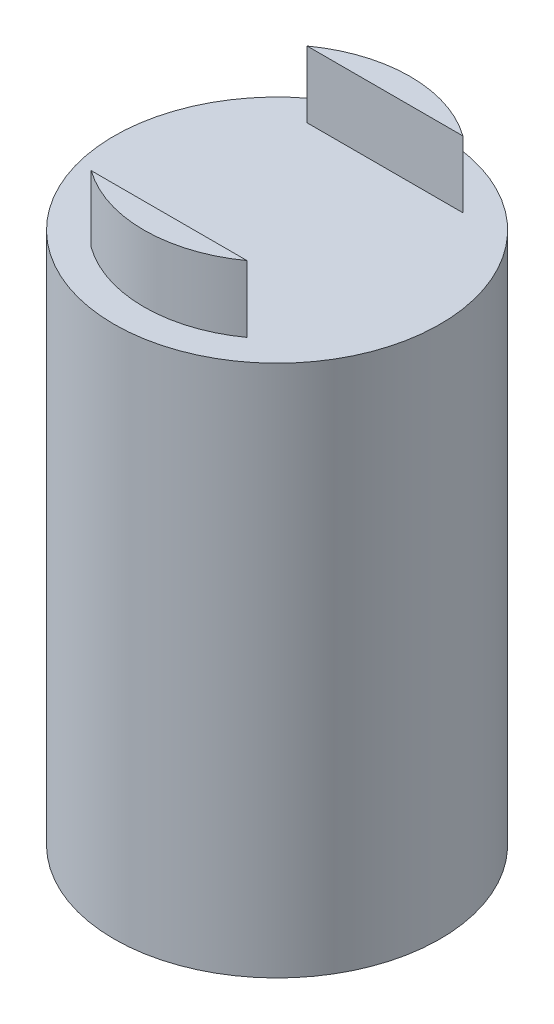
ISO-10303-21;
HEADER;
FILE_DESCRIPTION(('STEP AP214'),'2;1');
FILE_NAME('part.step','',(''),(''),'','','');
FILE_SCHEMA(('AUTOMOTIVE_DESIGN { 1 0 10303 214 1 1 1 1 }'));
ENDSEC;
DATA;
#1=APPLICATION_CONTEXT('core data for automotive mechanical design processes');
#2=APPLICATION_PROTOCOL_DEFINITION('international standard','automotive_design',2000,#1);
#3=PRODUCT_CONTEXT('',#1,'mechanical');
#4=PRODUCT('Part','Part','',(#3));
#5=PRODUCT_RELATED_PRODUCT_CATEGORY('part','',(#4));
#6=PRODUCT_DEFINITION_FORMATION('','',#4);
#7=PRODUCT_DEFINITION_CONTEXT('part definition',#1,'design');
#8=PRODUCT_DEFINITION('design','',#6,#7);
#9=PRODUCT_DEFINITION_SHAPE('','',#8);
#10=(LENGTH_UNIT() NAMED_UNIT(*) SI_UNIT(.MILLI.,.METRE.));
#11=(NAMED_UNIT(*) PLANE_ANGLE_UNIT() SI_UNIT($,.RADIAN.));
#12=(NAMED_UNIT(*) SI_UNIT($,.STERADIAN.) SOLID_ANGLE_UNIT());
#13=UNCERTAINTY_MEASURE_WITH_UNIT(LENGTH_MEASURE(1.E-05),#10,'distance_accuracy_value','');
#14=(GEOMETRIC_REPRESENTATION_CONTEXT(3) GLOBAL_UNCERTAINTY_ASSIGNED_CONTEXT((#13)) GLOBAL_UNIT_ASSIGNED_CONTEXT((#10,
#11,#12)) REPRESENTATION_CONTEXT('',''));
#15=CARTESIAN_POINT('',(0.,0.,0.));
#16=DIRECTION('',(0.,0.,1.));
#17=DIRECTION('',(1.,0.,0.));
#18=AXIS2_PLACEMENT_3D('',#15,#16,#17);
#19=CARTESIAN_POINT('',(0.,101.6,0.));
#20=DIRECTION('',(0.,1.,0.));
#21=DIRECTION('',(0.,0.,1.));
#22=AXIS2_PLACEMENT_3D('',#19,#20,#21);
#23=PLANE('',#22);
#24=CARTESIAN_POINT('',(0.,101.6,0.));
#25=DIRECTION('',(0.,1.,0.));
#26=DIRECTION('',(0.,0.,1.));
#27=AXIS2_PLACEMENT_3D('',#24,#25,#26);
#28=CIRCLE('',#27,31.115);
#29=CARTESIAN_POINT('',(0.,101.6,31.115));
#30=VERTEX_POINT('',#29);
#31=EDGE_CURVE('E11',#30,#30,#28,.T.);
#32=ORIENTED_EDGE('',*,*,#31,.T.);
#33=EDGE_LOOP('',(#32));
#34=FACE_BOUND('',#33,.T.);
#35=CARTESIAN_POINT('',(0.,101.6,0.));
#36=DIRECTION('',(0.,1.,0.));
#37=DIRECTION('',(0.,0.,1.));
#38=AXIS2_PLACEMENT_3D('',#35,#36,#37);
#39=CIRCLE('',#38,25.4);
#40=CARTESIAN_POINT('',(14.859,101.6,-20.600245605332));
#41=VERTEX_POINT('',#40);
#42=CARTESIAN_POINT('',(-14.859,101.6,-20.600245605332));
#43=VERTEX_POINT('',#42);
#44=EDGE_CURVE('E114',#41,#43,#39,.T.);
#45=ORIENTED_EDGE('',*,*,#44,.F.);
#46=DIRECTION('',(1.,0.,0.));
#47=VECTOR('',#46,1.);
#48=CARTESIAN_POINT('',(0.,101.6,-20.600245605332));
#49=LINE('',#48,#47);
#50=EDGE_CURVE('E63',#43,#41,#49,.T.);
#51=ORIENTED_EDGE('',*,*,#50,.F.);
#52=EDGE_LOOP('',(#45,#51));
#53=FACE_BOUND('',#52,.T.);
#54=DIRECTION('',(1.,0.,0.));
#55=VECTOR('',#54,1.);
#56=CARTESIAN_POINT('',(0.,101.6,20.600245605332));
#57=LINE('',#56,#55);
#58=CARTESIAN_POINT('',(-14.859,101.6,20.6002456053319));
#59=VERTEX_POINT('',#58);
#60=CARTESIAN_POINT('',(14.859,101.6,20.600245605332));
#61=VERTEX_POINT('',#60);
#62=EDGE_CURVE('E55',#59,#61,#57,.T.);
#63=ORIENTED_EDGE('',*,*,#62,.T.);
#64=CARTESIAN_POINT('',(0.,101.6,0.));
#65=DIRECTION('',(0.,1.,0.));
#66=DIRECTION('',(0.,0.,1.));
#67=AXIS2_PLACEMENT_3D('',#64,#65,#66);
#68=CIRCLE('',#67,25.4);
#69=EDGE_CURVE('E100',#59,#61,#68,.T.);
#70=ORIENTED_EDGE('',*,*,#69,.F.);
#71=EDGE_LOOP('',(#63,#70));
#72=FACE_BOUND('',#71,.T.);
#73=ADVANCED_FACE('F39',(#34,#53,#72),#23,.T.);
#74=CARTESIAN_POINT('',(0.,101.6,0.));
#75=DIRECTION('',(0.,-1.,0.));
#76=DIRECTION('',(0.,0.,-1.));
#77=AXIS2_PLACEMENT_3D('',#74,#75,#76);
#78=CYLINDRICAL_SURFACE('',#77,31.115);
#79=ORIENTED_EDGE('',*,*,#31,.F.);
#80=EDGE_LOOP('',(#79));
#81=FACE_BOUND('',#80,.T.);
#82=CARTESIAN_POINT('',(0.,0.,0.));
#83=DIRECTION('',(0.,1.,0.));
#84=DIRECTION('',(0.,0.,1.));
#85=AXIS2_PLACEMENT_3D('',#82,#83,#84);
#86=CIRCLE('',#85,31.115);
#87=CARTESIAN_POINT('',(0.,0.,31.115));
#88=VERTEX_POINT('',#87);
#89=EDGE_CURVE('E43',#88,#88,#86,.T.);
#90=ORIENTED_EDGE('',*,*,#89,.T.);
#91=EDGE_LOOP('',(#90));
#92=FACE_BOUND('',#91,.T.);
#93=ADVANCED_FACE('F41',(#81,#92),#78,.T.);
#94=CARTESIAN_POINT('',(0.,0.,0.));
#95=DIRECTION('',(0.,1.,0.));
#96=DIRECTION('',(0.,0.,1.));
#97=AXIS2_PLACEMENT_3D('',#94,#95,#96);
#98=PLANE('',#97);
#99=ORIENTED_EDGE('',*,*,#89,.F.);
#100=EDGE_LOOP('',(#99));
#101=FACE_BOUND('',#100,.T.);
#102=ADVANCED_FACE('F133',(#101),#98,.F.);
#103=CARTESIAN_POINT('',(0.,114.3,-20.600245605332));
#104=DIRECTION('',(0.,0.,-1.));
#105=DIRECTION('',(-1.,0.,0.));
#106=AXIS2_PLACEMENT_3D('',#103,#104,#105);
#107=PLANE('',#106);
#108=ORIENTED_EDGE('',*,*,#50,.T.);
#109=DIRECTION('',(0.,-1.,0.));
#110=VECTOR('',#109,1.);
#111=CARTESIAN_POINT('',(14.859,114.3,-20.6002456053321));
#112=LINE('',#111,#110);
#113=CARTESIAN_POINT('',(14.859,114.3,-20.6002456053321));
#114=VERTEX_POINT('',#113);
#115=EDGE_CURVE('E124',#114,#41,#112,.T.);
#116=ORIENTED_EDGE('',*,*,#115,.F.);
#117=DIRECTION('',(1.,0.,0.));
#118=VECTOR('',#117,1.);
#119=CARTESIAN_POINT('',(0.,114.3,-20.600245605332));
#120=LINE('',#119,#118);
#121=CARTESIAN_POINT('',(-14.859,114.3,-20.600245605332));
#122=VERTEX_POINT('',#121);
#123=EDGE_CURVE('E109',#122,#114,#120,.T.);
#124=ORIENTED_EDGE('',*,*,#123,.F.);
#125=DIRECTION('',(0.,-1.,0.));
#126=VECTOR('',#125,1.);
#127=CARTESIAN_POINT('',(-14.859,114.3,-20.600245605332));
#128=LINE('',#127,#126);
#129=EDGE_CURVE('E117',#122,#43,#128,.T.);
#130=ORIENTED_EDGE('',*,*,#129,.T.);
#131=EDGE_LOOP('',(#108,#116,#124,#130));
#132=FACE_BOUND('',#131,.T.);
#133=ADVANCED_FACE('F135',(#132),#107,.F.);
#134=CARTESIAN_POINT('',(0.,114.3,0.));
#135=DIRECTION('',(0.,-1.,0.));
#136=DIRECTION('',(0.,0.,-1.));
#137=AXIS2_PLACEMENT_3D('',#134,#135,#136);
#138=CYLINDRICAL_SURFACE('',#137,25.4);
#139=ORIENTED_EDGE('',*,*,#44,.T.);
#140=ORIENTED_EDGE('',*,*,#129,.F.);
#141=CARTESIAN_POINT('',(0.,114.3,0.));
#142=DIRECTION('',(0.,1.,0.));
#143=DIRECTION('',(0.,0.,1.));
#144=AXIS2_PLACEMENT_3D('',#141,#142,#143);
#145=CIRCLE('',#144,25.4);
#146=EDGE_CURVE('E113',#114,#122,#145,.T.);
#147=ORIENTED_EDGE('',*,*,#146,.F.);
#148=ORIENTED_EDGE('',*,*,#115,.T.);
#149=EDGE_LOOP('',(#139,#140,#147,#148));
#150=FACE_BOUND('',#149,.T.);
#151=ADVANCED_FACE('F140',(#150),#138,.T.);
#152=CARTESIAN_POINT('',(0.,114.3,0.));
#153=DIRECTION('',(0.,1.,0.));
#154=DIRECTION('',(0.,0.,1.));
#155=AXIS2_PLACEMENT_3D('',#152,#153,#154);
#156=PLANE('',#155);
#157=ORIENTED_EDGE('',*,*,#123,.T.);
#158=ORIENTED_EDGE('',*,*,#146,.T.);
#159=EDGE_LOOP('',(#157,#158));
#160=FACE_BOUND('',#159,.T.);
#161=ADVANCED_FACE('F152',(#160),#156,.T.);
#162=CARTESIAN_POINT('',(0.,114.3,20.600245605332));
#163=DIRECTION('',(0.,0.,-1.));
#164=DIRECTION('',(-1.,0.,0.));
#165=AXIS2_PLACEMENT_3D('',#162,#163,#164);
#166=PLANE('',#165);
#167=ORIENTED_EDGE('',*,*,#62,.F.);
#168=DIRECTION('',(0.,-1.,0.));
#169=VECTOR('',#168,1.);
#170=CARTESIAN_POINT('',(-14.8590000000001,114.3,20.600245605332));
#171=LINE('',#170,#169);
#172=CARTESIAN_POINT('',(-14.8590000000001,114.3,20.600245605332));
#173=VERTEX_POINT('',#172);
#174=EDGE_CURVE('E81',#173,#59,#171,.T.);
#175=ORIENTED_EDGE('',*,*,#174,.F.);
#176=DIRECTION('',(1.,0.,0.));
#177=VECTOR('',#176,1.);
#178=CARTESIAN_POINT('',(0.,114.3,20.600245605332));
#179=LINE('',#178,#177);
#180=CARTESIAN_POINT('',(14.859,114.3,20.600245605332));
#181=VERTEX_POINT('',#180);
#182=EDGE_CURVE('E85',#173,#181,#179,.T.);
#183=ORIENTED_EDGE('',*,*,#182,.T.);
#184=DIRECTION('',(0.,-1.,0.));
#185=VECTOR('',#184,1.);
#186=CARTESIAN_POINT('',(14.859,114.3,20.600245605332));
#187=LINE('',#186,#185);
#188=EDGE_CURVE('E90',#181,#61,#187,.T.);
#189=ORIENTED_EDGE('',*,*,#188,.T.);
#190=EDGE_LOOP('',(#167,#175,#183,#189));
#191=FACE_BOUND('',#190,.T.);
#192=ADVANCED_FACE('F83',(#191),#166,.T.);
#193=CARTESIAN_POINT('',(0.,114.3,0.));
#194=DIRECTION('',(0.,-1.,0.));
#195=DIRECTION('',(0.,0.,-1.));
#196=AXIS2_PLACEMENT_3D('',#193,#194,#195);
#197=CYLINDRICAL_SURFACE('',#196,25.4);
#198=ORIENTED_EDGE('',*,*,#69,.T.);
#199=ORIENTED_EDGE('',*,*,#188,.F.);
#200=CARTESIAN_POINT('',(0.,114.3,0.));
#201=DIRECTION('',(0.,1.,0.));
#202=DIRECTION('',(0.,0.,1.));
#203=AXIS2_PLACEMENT_3D('',#200,#201,#202);
#204=CIRCLE('',#203,25.4);
#205=EDGE_CURVE('E93',#173,#181,#204,.T.);
#206=ORIENTED_EDGE('',*,*,#205,.F.);
#207=ORIENTED_EDGE('',*,*,#174,.T.);
#208=EDGE_LOOP('',(#198,#199,#206,#207));
#209=FACE_BOUND('',#208,.T.);
#210=ADVANCED_FACE('F94',(#209),#197,.T.);
#211=CARTESIAN_POINT('',(0.,114.3,0.));
#212=DIRECTION('',(0.,1.,0.));
#213=DIRECTION('',(0.,0.,1.));
#214=AXIS2_PLACEMENT_3D('',#211,#212,#213);
#215=PLANE('',#214);
#216=ORIENTED_EDGE('',*,*,#182,.F.);
#217=ORIENTED_EDGE('',*,*,#205,.T.);
#218=EDGE_LOOP('',(#216,#217));
#219=FACE_BOUND('',#218,.T.);
#220=ADVANCED_FACE('F98',(#219),#215,.T.);
#221=CLOSED_SHELL('',(#73,#93,#102,#133,#151,#161,#192,#210,#220));
#222=MANIFOLD_SOLID_BREP('B2',#221);
#223=ADVANCED_BREP_SHAPE_REPRESENTATION('',(#18,#222),#14);
#224=SHAPE_DEFINITION_REPRESENTATION(#9,#223);
ENDSEC;
END-ISO-10303-21;
